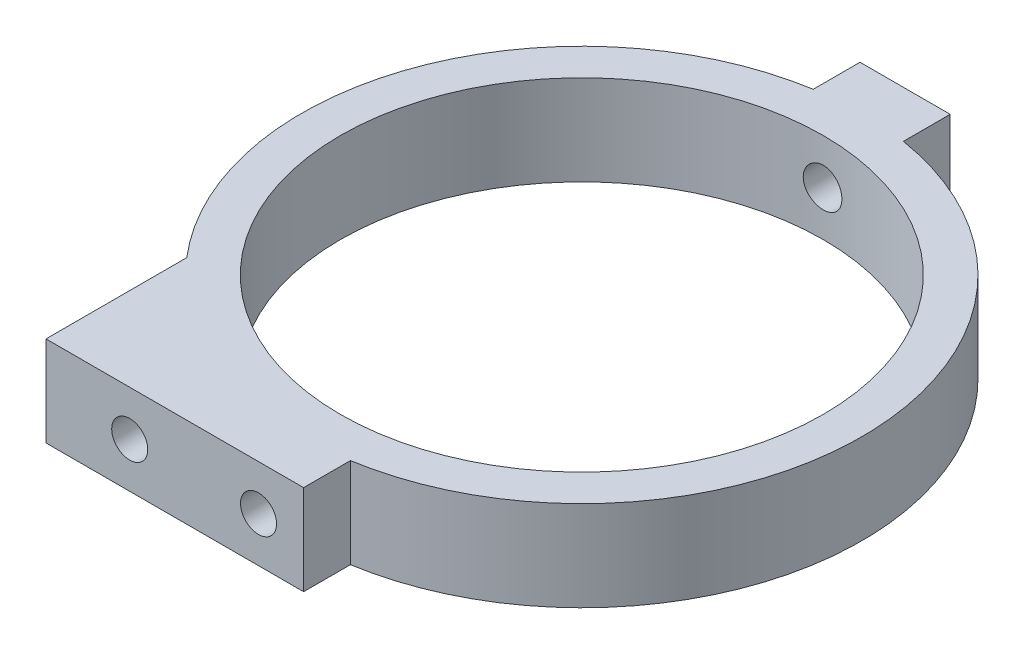
ISO-10303-21;
HEADER;
FILE_DESCRIPTION(('STEP AP214'),'2;1');
FILE_NAME('part.step','',(''),(''),'','','');
FILE_SCHEMA(('AUTOMOTIVE_DESIGN { 1 0 10303 214 1 1 1 1 }'));
ENDSEC;
DATA;
#1=APPLICATION_CONTEXT('core data for automotive mechanical design processes');
#2=APPLICATION_PROTOCOL_DEFINITION('international standard','automotive_design',2000,#1);
#3=PRODUCT_CONTEXT('',#1,'mechanical');
#4=PRODUCT('Part','Part','',(#3));
#5=PRODUCT_RELATED_PRODUCT_CATEGORY('part','',(#4));
#6=PRODUCT_DEFINITION_FORMATION('','',#4);
#7=PRODUCT_DEFINITION_CONTEXT('part definition',#1,'design');
#8=PRODUCT_DEFINITION('design','',#6,#7);
#9=PRODUCT_DEFINITION_SHAPE('','',#8);
#10=(LENGTH_UNIT() NAMED_UNIT(*) SI_UNIT(.MILLI.,.METRE.));
#11=(NAMED_UNIT(*) PLANE_ANGLE_UNIT() SI_UNIT($,.RADIAN.));
#12=(NAMED_UNIT(*) SI_UNIT($,.STERADIAN.) SOLID_ANGLE_UNIT());
#13=UNCERTAINTY_MEASURE_WITH_UNIT(LENGTH_MEASURE(1.E-05),#10,'distance_accuracy_value','');
#14=(GEOMETRIC_REPRESENTATION_CONTEXT(3) GLOBAL_UNCERTAINTY_ASSIGNED_CONTEXT((#13)) GLOBAL_UNIT_ASSIGNED_CONTEXT((#10,
#11,#12)) REPRESENTATION_CONTEXT('',''));
#15=CARTESIAN_POINT('',(0.,0.,0.));
#16=DIRECTION('',(0.,0.,1.));
#17=DIRECTION('',(1.,0.,0.));
#18=AXIS2_PLACEMENT_3D('',#15,#16,#17);
#19=CARTESIAN_POINT('',(0.,7.,0.));
#20=DIRECTION('',(0.,1.,0.));
#21=DIRECTION('',(0.,0.,-1.));
#22=AXIS2_PLACEMENT_3D('',#19,#20,#21);
#23=PLANE('',#22);
#24=DIRECTION('',(0.,0.,1.));
#25=VECTOR('',#24,1.);
#26=CARTESIAN_POINT('',(3.5,7.,-25.1));
#27=LINE('',#26,#25);
#28=CARTESIAN_POINT('',(3.5,7.,-25.1));
#29=VERTEX_POINT('',#28);
#30=CARTESIAN_POINT('',(3.5,7.,-21.4665437367081));
#31=VERTEX_POINT('',#30);
#32=EDGE_CURVE('E159',#29,#31,#27,.T.);
#33=ORIENTED_EDGE('',*,*,#32,.F.);
#34=DIRECTION('',(-1.,0.,0.));
#35=VECTOR('',#34,1.);
#36=CARTESIAN_POINT('',(3.5,7.,-25.1));
#37=LINE('',#36,#35);
#38=CARTESIAN_POINT('',(-3.5,7.,-25.1));
#39=VERTEX_POINT('',#38);
#40=EDGE_CURVE('E136',#29,#39,#37,.T.);
#41=ORIENTED_EDGE('',*,*,#40,.T.);
#42=DIRECTION('',(0.,0.,1.));
#43=VECTOR('',#42,1.);
#44=CARTESIAN_POINT('',(-3.5,7.,-25.1));
#45=LINE('',#44,#43);
#46=CARTESIAN_POINT('',(-3.5,7.,-21.4665437367081));
#47=VERTEX_POINT('',#46);
#48=EDGE_CURVE('E119',#39,#47,#45,.T.);
#49=ORIENTED_EDGE('',*,*,#48,.T.);
#50=CARTESIAN_POINT('',(0.,7.,0.));
#51=DIRECTION('',(0.,-1.,0.));
#52=DIRECTION('',(0.,0.,-1.));
#53=AXIS2_PLACEMENT_3D('',#50,#51,#52);
#54=CIRCLE('',#53,21.75);
#55=CARTESIAN_POINT('',(-16.5,7.,14.1708327207684));
#56=VERTEX_POINT('',#55);
#57=EDGE_CURVE('E128',#56,#47,#54,.T.);
#58=ORIENTED_EDGE('',*,*,#57,.F.);
#59=DIRECTION('',(0.,0.,1.));
#60=VECTOR('',#59,1.);
#61=CARTESIAN_POINT('',(-16.5,7.,25.1));
#62=LINE('',#61,#60);
#63=CARTESIAN_POINT('',(-16.5,7.,25.1));
#64=VERTEX_POINT('',#63);
#65=EDGE_CURVE('E190',#56,#64,#62,.T.);
#66=ORIENTED_EDGE('',*,*,#65,.T.);
#67=DIRECTION('',(-1.,0.,0.));
#68=VECTOR('',#67,1.);
#69=CARTESIAN_POINT('',(3.5,7.,25.1));
#70=LINE('',#69,#68);
#71=CARTESIAN_POINT('',(3.5,7.,25.1));
#72=VERTEX_POINT('',#71);
#73=EDGE_CURVE('E132',#72,#64,#70,.T.);
#74=ORIENTED_EDGE('',*,*,#73,.F.);
#75=DIRECTION('',(0.,0.,-1.));
#76=VECTOR('',#75,1.);
#77=CARTESIAN_POINT('',(3.5,7.,25.1));
#78=LINE('',#77,#76);
#79=CARTESIAN_POINT('',(3.5,7.,21.4665437367081));
#80=VERTEX_POINT('',#79);
#81=EDGE_CURVE('E175',#72,#80,#78,.T.);
#82=ORIENTED_EDGE('',*,*,#81,.T.);
#83=CARTESIAN_POINT('',(0.,7.,0.));
#84=DIRECTION('',(0.,-1.,0.));
#85=DIRECTION('',(0.,0.,-1.));
#86=AXIS2_PLACEMENT_3D('',#83,#84,#85);
#87=CIRCLE('',#86,21.75);
#88=EDGE_CURVE('E164',#31,#80,#87,.T.);
#89=ORIENTED_EDGE('',*,*,#88,.F.);
#90=EDGE_LOOP('',(#33,#41,#49,#58,#66,#74,#82,#89));
#91=FACE_BOUND('',#90,.T.);
#92=CARTESIAN_POINT('',(0.,7.,0.));
#93=DIRECTION('',(0.,-1.,0.));
#94=DIRECTION('',(0.,0.,-1.));
#95=AXIS2_PLACEMENT_3D('',#92,#93,#94);
#96=CIRCLE('',#95,18.75);
#97=CARTESIAN_POINT('',(0.,7.,-18.75));
#98=VERTEX_POINT('',#97);
#99=EDGE_CURVE('E145',#98,#98,#96,.T.);
#100=ORIENTED_EDGE('',*,*,#99,.T.);
#101=EDGE_LOOP('',(#100));
#102=FACE_BOUND('',#101,.T.);
#103=ADVANCED_FACE('F41',(#91,#102),#23,.T.);
#104=CARTESIAN_POINT('',(0.,0.,0.));
#105=DIRECTION('',(0.,1.,0.));
#106=DIRECTION('',(0.,0.,-1.));
#107=AXIS2_PLACEMENT_3D('',#104,#105,#106);
#108=PLANE('',#107);
#109=DIRECTION('',(0.,0.,1.));
#110=VECTOR('',#109,1.);
#111=CARTESIAN_POINT('',(3.5,0.,-25.1));
#112=LINE('',#111,#110);
#113=CARTESIAN_POINT('',(3.5,0.,-25.1));
#114=VERTEX_POINT('',#113);
#115=CARTESIAN_POINT('',(3.5,0.,-21.4665437367081));
#116=VERTEX_POINT('',#115);
#117=EDGE_CURVE('E141',#114,#116,#112,.T.);
#118=ORIENTED_EDGE('',*,*,#117,.T.);
#119=CARTESIAN_POINT('',(0.,0.,0.));
#120=DIRECTION('',(0.,-1.,0.));
#121=DIRECTION('',(0.,0.,-1.));
#122=AXIS2_PLACEMENT_3D('',#119,#120,#121);
#123=CIRCLE('',#122,21.75);
#124=CARTESIAN_POINT('',(3.5,0.,21.4665437367081));
#125=VERTEX_POINT('',#124);
#126=EDGE_CURVE('E144',#116,#125,#123,.T.);
#127=ORIENTED_EDGE('',*,*,#126,.T.);
#128=DIRECTION('',(0.,0.,-1.));
#129=VECTOR('',#128,1.);
#130=CARTESIAN_POINT('',(3.5,0.,25.1));
#131=LINE('',#130,#129);
#132=CARTESIAN_POINT('',(3.5,0.,25.1));
#133=VERTEX_POINT('',#132);
#134=EDGE_CURVE('E148',#133,#125,#131,.T.);
#135=ORIENTED_EDGE('',*,*,#134,.F.);
#136=DIRECTION('',(-1.,0.,0.));
#137=VECTOR('',#136,1.);
#138=CARTESIAN_POINT('',(3.5,0.,25.1));
#139=LINE('',#138,#137);
#140=CARTESIAN_POINT('',(-16.5,0.,25.1));
#141=VERTEX_POINT('',#140);
#142=EDGE_CURVE('E151',#133,#141,#139,.T.);
#143=ORIENTED_EDGE('',*,*,#142,.T.);
#144=DIRECTION('',(0.,0.,1.));
#145=VECTOR('',#144,1.);
#146=CARTESIAN_POINT('',(-16.5,0.,25.1));
#147=LINE('',#146,#145);
#148=CARTESIAN_POINT('',(-16.5,0.,14.1708327207684));
#149=VERTEX_POINT('',#148);
#150=EDGE_CURVE('E192',#149,#141,#147,.T.);
#151=ORIENTED_EDGE('',*,*,#150,.F.);
#152=CARTESIAN_POINT('',(0.,0.,0.));
#153=DIRECTION('',(0.,-1.,0.));
#154=DIRECTION('',(0.,0.,-1.));
#155=AXIS2_PLACEMENT_3D('',#152,#153,#154);
#156=CIRCLE('',#155,21.75);
#157=CARTESIAN_POINT('',(-3.5,0.,-21.4665437367081));
#158=VERTEX_POINT('',#157);
#159=EDGE_CURVE('E154',#149,#158,#156,.T.);
#160=ORIENTED_EDGE('',*,*,#159,.T.);
#161=DIRECTION('',(0.,0.,1.));
#162=VECTOR('',#161,1.);
#163=CARTESIAN_POINT('',(-3.5,0.,-25.1));
#164=LINE('',#163,#162);
#165=CARTESIAN_POINT('',(-3.5,0.,-25.1));
#166=VERTEX_POINT('',#165);
#167=EDGE_CURVE('E122',#166,#158,#164,.T.);
#168=ORIENTED_EDGE('',*,*,#167,.F.);
#169=DIRECTION('',(-1.,0.,0.));
#170=VECTOR('',#169,1.);
#171=CARTESIAN_POINT('',(3.5,0.,-25.1));
#172=LINE('',#171,#170);
#173=EDGE_CURVE('E157',#114,#166,#172,.T.);
#174=ORIENTED_EDGE('',*,*,#173,.F.);
#175=EDGE_LOOP('',(#118,#127,#135,#143,#151,#160,#168,#174));
#176=FACE_BOUND('',#175,.T.);
#177=CARTESIAN_POINT('',(0.,0.,0.));
#178=DIRECTION('',(0.,-1.,0.));
#179=DIRECTION('',(0.,0.,-1.));
#180=AXIS2_PLACEMENT_3D('',#177,#178,#179);
#181=CIRCLE('',#180,18.75);
#182=CARTESIAN_POINT('',(0.,0.,-18.75));
#183=VERTEX_POINT('',#182);
#184=EDGE_CURVE('E178',#183,#183,#181,.T.);
#185=ORIENTED_EDGE('',*,*,#184,.F.);
#186=EDGE_LOOP('',(#185));
#187=FACE_BOUND('',#186,.T.);
#188=ADVANCED_FACE('F172',(#176,#187),#108,.F.);
#189=CARTESIAN_POINT('',(3.5,7.,-25.1));
#190=DIRECTION('',(-1.,0.,0.));
#191=DIRECTION('',(0.,0.,-1.));
#192=AXIS2_PLACEMENT_3D('',#189,#190,#191);
#193=PLANE('',#192);
#194=ORIENTED_EDGE('',*,*,#117,.F.);
#195=DIRECTION('',(0.,-1.,0.));
#196=VECTOR('',#195,1.);
#197=CARTESIAN_POINT('',(3.5,7.,-25.1));
#198=LINE('',#197,#196);
#199=EDGE_CURVE('E71',#29,#114,#198,.T.);
#200=ORIENTED_EDGE('',*,*,#199,.F.);
#201=ORIENTED_EDGE('',*,*,#32,.T.);
#202=DIRECTION('',(0.,-1.,0.));
#203=VECTOR('',#202,1.);
#204=CARTESIAN_POINT('',(3.5,7.,-21.4665437367081));
#205=LINE('',#204,#203);
#206=EDGE_CURVE('E11',#31,#116,#205,.T.);
#207=ORIENTED_EDGE('',*,*,#206,.T.);
#208=EDGE_LOOP('',(#194,#200,#201,#207));
#209=FACE_BOUND('',#208,.T.);
#210=ADVANCED_FACE('F43',(#209),#193,.F.);
#211=CARTESIAN_POINT('',(0.,7.,0.));
#212=DIRECTION('',(0.,-1.,0.));
#213=DIRECTION('',(0.,0.,1.));
#214=AXIS2_PLACEMENT_3D('',#211,#212,#213);
#215=CYLINDRICAL_SURFACE('',#214,21.75);
#216=ORIENTED_EDGE('',*,*,#126,.F.);
#217=ORIENTED_EDGE('',*,*,#206,.F.);
#218=ORIENTED_EDGE('',*,*,#88,.T.);
#219=DIRECTION('',(0.,-1.,0.));
#220=VECTOR('',#219,1.);
#221=CARTESIAN_POINT('',(3.5,7.,21.4665437367081));
#222=LINE('',#221,#220);
#223=EDGE_CURVE('E55',#80,#125,#222,.T.);
#224=ORIENTED_EDGE('',*,*,#223,.T.);
#225=EDGE_LOOP('',(#216,#217,#218,#224));
#226=FACE_BOUND('',#225,.T.);
#227=ADVANCED_FACE('F163',(#226),#215,.T.);
#228=CARTESIAN_POINT('',(3.5,7.,25.1));
#229=DIRECTION('',(1.,0.,0.));
#230=DIRECTION('',(0.,0.,1.));
#231=AXIS2_PLACEMENT_3D('',#228,#229,#230);
#232=PLANE('',#231);
#233=ORIENTED_EDGE('',*,*,#134,.T.);
#234=ORIENTED_EDGE('',*,*,#223,.F.);
#235=ORIENTED_EDGE('',*,*,#81,.F.);
#236=DIRECTION('',(0.,-1.,0.));
#237=VECTOR('',#236,1.);
#238=CARTESIAN_POINT('',(3.5,7.,25.1));
#239=LINE('',#238,#237);
#240=EDGE_CURVE('E124',#72,#133,#239,.T.);
#241=ORIENTED_EDGE('',*,*,#240,.T.);
#242=EDGE_LOOP('',(#233,#234,#235,#241));
#243=FACE_BOUND('',#242,.T.);
#244=ADVANCED_FACE('F169',(#243),#232,.T.);
#245=CARTESIAN_POINT('',(3.5,7.,25.1));
#246=DIRECTION('',(0.,0.,-1.));
#247=DIRECTION('',(1.,0.,0.));
#248=AXIS2_PLACEMENT_3D('',#245,#246,#247);
#249=PLANE('',#248);
#250=CARTESIAN_POINT('',(-10.,3.5,25.1));
#251=DIRECTION('',(0.,0.,-1.));
#252=DIRECTION('',(-1.,0.,0.));
#253=AXIS2_PLACEMENT_3D('',#250,#251,#252);
#254=CIRCLE('',#253,1.4);
#255=CARTESIAN_POINT('',(-11.4,3.5,25.1));
#256=VERTEX_POINT('',#255);
#257=EDGE_CURVE('E198',#256,#256,#254,.T.);
#258=ORIENTED_EDGE('',*,*,#257,.T.);
#259=EDGE_LOOP('',(#258));
#260=FACE_BOUND('',#259,.T.);
#261=CARTESIAN_POINT('',(0.,3.5,25.1));
#262=DIRECTION('',(0.,0.,-1.));
#263=DIRECTION('',(-1.,0.,0.));
#264=AXIS2_PLACEMENT_3D('',#261,#262,#263);
#265=CIRCLE('',#264,1.4);
#266=CARTESIAN_POINT('',(-1.40000000000001,3.5,25.1));
#267=VERTEX_POINT('',#266);
#268=EDGE_CURVE('E201',#267,#267,#265,.T.);
#269=ORIENTED_EDGE('',*,*,#268,.T.);
#270=EDGE_LOOP('',(#269));
#271=FACE_BOUND('',#270,.T.);
#272=ORIENTED_EDGE('',*,*,#142,.F.);
#273=ORIENTED_EDGE('',*,*,#240,.F.);
#274=ORIENTED_EDGE('',*,*,#73,.T.);
#275=DIRECTION('',(0.,-1.,0.));
#276=VECTOR('',#275,1.);
#277=CARTESIAN_POINT('',(-16.5,7.,25.1));
#278=LINE('',#277,#276);
#279=EDGE_CURVE('E187',#64,#141,#278,.T.);
#280=ORIENTED_EDGE('',*,*,#279,.T.);
#281=EDGE_LOOP('',(#272,#273,#274,#280));
#282=FACE_BOUND('',#281,.T.);
#283=ADVANCED_FACE('F185',(#260,#271,#282),#249,.F.);
#284=CARTESIAN_POINT('',(0.,7.,0.));
#285=DIRECTION('',(0.,-1.,0.));
#286=DIRECTION('',(0.,0.,1.));
#287=AXIS2_PLACEMENT_3D('',#284,#285,#286);
#288=CYLINDRICAL_SURFACE('',#287,21.75);
#289=ORIENTED_EDGE('',*,*,#57,.T.);
#290=DIRECTION('',(0.,-1.,0.));
#291=VECTOR('',#290,1.);
#292=CARTESIAN_POINT('',(-3.5,7.,-21.4665437367081));
#293=LINE('',#292,#291);
#294=EDGE_CURVE('E116',#47,#158,#293,.T.);
#295=ORIENTED_EDGE('',*,*,#294,.T.);
#296=ORIENTED_EDGE('',*,*,#159,.F.);
#297=DIRECTION('',(0.,-1.,0.));
#298=VECTOR('',#297,1.);
#299=CARTESIAN_POINT('',(-16.5,7.,14.1708327207684));
#300=LINE('',#299,#298);
#301=EDGE_CURVE('E62',#56,#149,#300,.T.);
#302=ORIENTED_EDGE('',*,*,#301,.F.);
#303=EDGE_LOOP('',(#289,#295,#296,#302));
#304=FACE_BOUND('',#303,.T.);
#305=ADVANCED_FACE('F129',(#304),#288,.T.);
#306=CARTESIAN_POINT('',(-3.5,7.,-25.1));
#307=DIRECTION('',(-1.,0.,0.));
#308=DIRECTION('',(0.,0.,-1.));
#309=AXIS2_PLACEMENT_3D('',#306,#307,#308);
#310=PLANE('',#309);
#311=ORIENTED_EDGE('',*,*,#167,.T.);
#312=ORIENTED_EDGE('',*,*,#294,.F.);
#313=ORIENTED_EDGE('',*,*,#48,.F.);
#314=DIRECTION('',(0.,-1.,0.));
#315=VECTOR('',#314,1.);
#316=CARTESIAN_POINT('',(-3.5,7.,-25.1));
#317=LINE('',#316,#315);
#318=EDGE_CURVE('E125',#39,#166,#317,.T.);
#319=ORIENTED_EDGE('',*,*,#318,.T.);
#320=EDGE_LOOP('',(#311,#312,#313,#319));
#321=FACE_BOUND('',#320,.T.);
#322=ADVANCED_FACE('F117',(#321),#310,.T.);
#323=CARTESIAN_POINT('',(3.5,7.,-25.1));
#324=DIRECTION('',(0.,0.,-1.));
#325=DIRECTION('',(1.,0.,0.));
#326=AXIS2_PLACEMENT_3D('',#323,#324,#325);
#327=PLANE('',#326);
#328=CARTESIAN_POINT('',(0.,3.5,-25.1));
#329=DIRECTION('',(0.,0.,1.));
#330=DIRECTION('',(1.,0.,0.));
#331=AXIS2_PLACEMENT_3D('',#328,#329,#330);
#332=CIRCLE('',#331,1.5);
#333=CARTESIAN_POINT('',(1.5,3.5,-25.1));
#334=VERTEX_POINT('',#333);
#335=EDGE_CURVE('E206',#334,#334,#332,.T.);
#336=ORIENTED_EDGE('',*,*,#335,.T.);
#337=EDGE_LOOP('',(#336));
#338=FACE_BOUND('',#337,.T.);
#339=ORIENTED_EDGE('',*,*,#173,.T.);
#340=ORIENTED_EDGE('',*,*,#318,.F.);
#341=ORIENTED_EDGE('',*,*,#40,.F.);
#342=ORIENTED_EDGE('',*,*,#199,.T.);
#343=EDGE_LOOP('',(#339,#340,#341,#342));
#344=FACE_BOUND('',#343,.T.);
#345=ADVANCED_FACE('F227',(#338,#344),#327,.T.);
#346=CARTESIAN_POINT('',(0.,7.,0.));
#347=DIRECTION('',(0.,-1.,0.));
#348=DIRECTION('',(0.,0.,1.));
#349=AXIS2_PLACEMENT_3D('',#346,#347,#348);
#350=CYLINDRICAL_SURFACE('',#349,18.75);
#351=CARTESIAN_POINT('',(1.5,3.5,-18.6899036915657));
#352=CARTESIAN_POINT('',(1.49999632062772,3.41588910974437,-18.6899044892014));
#353=CARTESIAN_POINT('',(1.49290156215183,3.3317206652062,-18.6904775942158));
#354=CARTESIAN_POINT('',(1.46470318774386,3.16571175768858,-18.6927081206783));
#355=CARTESIAN_POINT('',(1.44358362109166,3.08387405616433,-18.6943667767162));
#356=CARTESIAN_POINT('',(1.38794959023862,2.92495508136651,-18.6985793452206));
#357=CARTESIAN_POINT('',(1.35344262614257,2.84787117282067,-18.7011327563356));
#358=CARTESIAN_POINT('',(1.27202646042832,2.70060821925846,-18.7068465005001));
#359=CARTESIAN_POINT('',(1.22511994393665,2.630427683824,-18.7100067021084));
#360=CARTESIAN_POINT('',(1.12011551831489,2.49877819168836,-18.7165863916315));
#361=CARTESIAN_POINT('',(1.06199424933048,2.43732789187484,-18.7200064115608));
#362=CARTESIAN_POINT('',(0.936259445760343,2.32504341460093,-18.7267155033906));
#363=CARTESIAN_POINT('',(0.868645500088394,2.27420969713547,-18.7300045696121));
#364=CARTESIAN_POINT('',(0.725734168475946,2.18453992472742,-18.7360861453358));
#365=CARTESIAN_POINT('',(0.650426681655086,2.14571991903267,-18.738877988498));
#366=CARTESIAN_POINT('',(0.494336491088885,2.08128219450257,-18.7436448358792));
#367=CARTESIAN_POINT('',(0.413553876517281,2.05566426070272,-18.745619853398));
#368=CARTESIAN_POINT('',(0.248991495760869,2.01841132760336,-18.7485268054688));
#369=CARTESIAN_POINT('',(0.165218575252358,2.00674626571047,-18.7494609822974));
#370=CARTESIAN_POINT('',(-0.00310101422522166,1.99763728747693,-18.7501885880184));
#371=CARTESIAN_POINT('',(-0.0876476697940369,2.00019312530925,-18.7499820366297));
#372=CARTESIAN_POINT('',(-0.254910958845742,2.01942877416144,-18.7484533122186));
#373=CARTESIAN_POINT('',(-0.337631336820587,2.03607625616637,-18.7471336928186));
#374=CARTESIAN_POINT('',(-0.499099950189813,2.08297238129014,-18.7435302217384));
#375=CARTESIAN_POINT('',(-0.577848150305161,2.11322114518559,-18.7412463614959));
#376=CARTESIAN_POINT('',(-0.729240075628612,2.18649731782168,-18.7359669873138));
#377=CARTESIAN_POINT('',(-0.801876748665349,2.22953923615441,-18.7329706660993));
#378=CARTESIAN_POINT('',(-0.938906754389632,2.32716937813201,-18.7266031809033));
#379=CARTESIAN_POINT('',(-1.00329993315168,2.38175781732721,-18.7232320099247));
#380=CARTESIAN_POINT('',(-1.12220402922705,2.50111371219672,-18.716482638835));
#381=CARTESIAN_POINT('',(-1.17668675797546,2.56590925405083,-18.7131044454878));
#382=CARTESIAN_POINT('',(-1.27400569041641,2.70374207490187,-18.7067312907922));
#383=CARTESIAN_POINT('',(-1.31684188556444,2.77677935994532,-18.7037363297249));
#384=CARTESIAN_POINT('',(-1.38965054864154,2.92904186429338,-18.6984681334495));
#385=CARTESIAN_POINT('',(-1.41962160308561,3.00826776240737,-18.6961949775527));
#386=CARTESIAN_POINT('',(-1.46582859989257,3.17064933913142,-18.6926292502436));
#387=CARTESIAN_POINT('',(-1.48206480809471,3.25380494164879,-18.6913366598524));
#388=CARTESIAN_POINT('',(-1.50030564278629,3.4214389223715,-18.6898814380755));
#389=CARTESIAN_POINT('',(-1.50234955607957,3.50591299971711,-18.6897156874231));
#390=CARTESIAN_POINT('',(-1.49225064585172,3.67400262104635,-18.690524676209));
#391=CARTESIAN_POINT('',(-1.48010794413208,3.75761817239478,-18.6914994058556));
#392=CARTESIAN_POINT('',(-1.44201322164018,3.92150472101421,-18.6944766801575));
#393=CARTESIAN_POINT('',(-1.41607949196744,4.00177999680187,-18.6964778632987));
#394=CARTESIAN_POINT('',(-1.35115745890298,4.15683972413565,-18.7012814234103));
#395=CARTESIAN_POINT('',(-1.31216896221481,4.23162409436024,-18.7040838122436));
#396=CARTESIAN_POINT('',(-1.22214454706965,4.373759059463,-18.7101815822911));
#397=CARTESIAN_POINT('',(-1.17108242281578,4.44109300986021,-18.7134780300796));
#398=CARTESIAN_POINT('',(-1.05839811840015,4.5662476479122,-18.7201888557784));
#399=CARTESIAN_POINT('',(-0.996775770633618,4.62406818454792,-18.7236032355598));
#400=CARTESIAN_POINT('',(-0.864550602263586,4.72868853250665,-18.7301744660023));
#401=CARTESIAN_POINT('',(-0.793927565253147,4.77546283652398,-18.7333307098241));
#402=CARTESIAN_POINT('',(-0.645806640765806,4.85648803992158,-18.7390213036078));
#403=CARTESIAN_POINT('',(-0.568308817352759,4.89073905598699,-18.7415556593639));
#404=CARTESIAN_POINT('',(-0.408730022480179,4.94570151548968,-18.7457141148762));
#405=CARTESIAN_POINT('',(-0.326654535286603,4.96642879824313,-18.7473392791795));
#406=CARTESIAN_POINT('',(-0.160174833719194,4.99380720003187,-18.7495005498768));
#407=CARTESIAN_POINT('',(-0.0757706596510529,5.00045856254326,-18.7500366751083));
#408=CARTESIAN_POINT('',(0.0927188866521085,4.99949357241986,-18.7499594956931));
#409=CARTESIAN_POINT('',(0.176804491059185,4.99191700058234,-18.7493493958487));
#410=CARTESIAN_POINT('',(0.342505049325764,4.96279408533884,-18.7470546664287));
#411=CARTESIAN_POINT('',(0.424119999621,4.94124772178048,-18.7453700353031));
#412=CARTESIAN_POINT('',(0.58256563894844,4.88480677611825,-18.7411153164152));
#413=CARTESIAN_POINT('',(0.6593965525984,4.8499128212543,-18.7385452702617));
#414=CARTESIAN_POINT('',(0.806115934271487,4.76777187152803,-18.7328074295552));
#415=CARTESIAN_POINT('',(0.8760045245382,4.72052509423304,-18.7296396455302));
#416=CARTESIAN_POINT('',(1.00705879886138,4.61487049786707,-18.7230514806532));
#417=CARTESIAN_POINT('',(1.06820077293534,4.55643330967203,-18.7196304499822));
#418=CARTESIAN_POINT('',(1.17983224819666,4.43010829215942,-18.7129268703636));
#419=CARTESIAN_POINT('',(1.23031916134281,4.36221817342083,-18.709644355215));
#420=CARTESIAN_POINT('',(1.31927004620408,4.21879254913323,-18.7035831840147));
#421=CARTESIAN_POINT('',(1.35771272607774,4.14324381313022,-18.7008054238702));
#422=CARTESIAN_POINT('',(1.42131855200279,3.98679387767989,-18.6960792751499));
#423=CARTESIAN_POINT('',(1.44649701682099,3.90589897459956,-18.6941299303474));
#424=CARTESIAN_POINT('',(1.47642337958161,3.77043630193827,-18.691784377361));
#425=CARTESIAN_POINT('',(1.48525291732771,3.71674059854125,-18.6910823459044));
#426=CARTESIAN_POINT('',(1.49704240943925,3.60870461027899,-18.6901417457999));
#427=CARTESIAN_POINT('',(1.5000023781296,3.55436432698718,-18.6899031760209));
#428=CARTESIAN_POINT('',(1.5,3.5,-18.6899036915657));
#429=B_SPLINE_CURVE_WITH_KNOTS('',3,(#351,#352,#353,#354,#355,#356,#357,#358,#359,#360,#361,
#362,#363,#364,#365,#366,#367,#368,#369,#370,#371,#372,#373,#374,#375,#376,#377,#378,#379,#380,
#381,#382,#383,#384,#385,#386,#387,#388,#389,#390,#391,#392,#393,#394,#395,#396,#397,#398,#399,
#400,#401,#402,#403,#404,#405,#406,#407,#408,#409,#410,#411,#412,#413,#414,#415,#416,#417,#418,
#419,#420,#421,#422,#423,#424,#425,#426,#427,#428),.UNSPECIFIED.,.T.,.F.,(4,2,2,2,2,2,2,2,2,2,2,
2,2,2,2,2,2,2,2,2,2,2,2,2,2,2,2,2,2,2,2,2,2,2,2,2,2,2,4),(0.,0.25213418203791,0.50455561402385,
0.756835834120728,1.00906146755583,1.26181826116902,1.51458600394927,1.7676899785965,
2.02078983191417,2.27334337309686,2.52589254857181,2.77786389180794,3.02983747254223,
3.28209793140011,3.53436309986935,3.78733494058949,4.0403069669025,4.29330677998519,
4.54630169612057,4.79859599700462,5.05088813179099,5.30284648195618,5.55480856292754,
5.80732263043169,6.05984070604075,6.31293630132195,6.56602953833693,6.8188258119051,
7.07161771273227,7.32370386856552,7.5757903880512,7.82786506275495,8.07993529802616,
8.33267638790938,8.5854787963961,8.83872562068804,9.09167932690653,9.25464441416333,
9.41760910369755),.UNSPECIFIED.);
#430=CARTESIAN_POINT('',(1.5,3.5,-18.6899036915657));
#431=VERTEX_POINT('',#430);
#432=EDGE_CURVE('E45',#431,#431,#429,.T.);
#433=ORIENTED_EDGE('',*,*,#432,.T.);
#434=EDGE_LOOP('',(#433));
#435=FACE_BOUND('',#434,.T.);
#436=ORIENTED_EDGE('',*,*,#99,.F.);
#437=EDGE_LOOP('',(#436));
#438=FACE_BOUND('',#437,.T.);
#439=ORIENTED_EDGE('',*,*,#184,.T.);
#440=EDGE_LOOP('',(#439));
#441=FACE_BOUND('',#440,.T.);
#442=ADVANCED_FACE('F218',(#435,#438,#441),#350,.F.);
#443=CARTESIAN_POINT('',(0.,3.5,-18.1));
#444=DIRECTION('',(0.,0.,-1.));
#445=DIRECTION('',(1.,0.,0.));
#446=AXIS2_PLACEMENT_3D('',#443,#444,#445);
#447=CYLINDRICAL_SURFACE('',#446,1.5);
#448=ORIENTED_EDGE('',*,*,#432,.F.);
#449=EDGE_LOOP('',(#448));
#450=FACE_BOUND('',#449,.T.);
#451=ORIENTED_EDGE('',*,*,#335,.F.);
#452=EDGE_LOOP('',(#451));
#453=FACE_BOUND('',#452,.T.);
#454=ADVANCED_FACE('F221',(#450,#453),#447,.F.);
#455=CARTESIAN_POINT('',(0.,3.5,20.1));
#456=DIRECTION('',(0.,0.,1.));
#457=DIRECTION('',(-1.,0.,0.));
#458=AXIS2_PLACEMENT_3D('',#455,#456,#457);
#459=CYLINDRICAL_SURFACE('',#458,1.4);
#460=CARTESIAN_POINT('',(0.,3.5,20.1));
#461=DIRECTION('',(0.,0.,-1.));
#462=DIRECTION('',(-1.,0.,0.));
#463=AXIS2_PLACEMENT_3D('',#460,#461,#462);
#464=CIRCLE('',#463,1.4);
#465=CARTESIAN_POINT('',(-1.4,3.5,20.1));
#466=VERTEX_POINT('',#465);
#467=EDGE_CURVE('E203',#466,#466,#464,.T.);
#468=ORIENTED_EDGE('',*,*,#467,.T.);
#469=EDGE_LOOP('',(#468));
#470=FACE_BOUND('',#469,.T.);
#471=ORIENTED_EDGE('',*,*,#268,.F.);
#472=EDGE_LOOP('',(#471));
#473=FACE_BOUND('',#472,.T.);
#474=ADVANCED_FACE('F224',(#470,#473),#459,.F.);
#475=CARTESIAN_POINT('',(0.,3.5,20.1));
#476=DIRECTION('',(0.,0.,1.));
#477=DIRECTION('',(-1.,0.,0.));
#478=AXIS2_PLACEMENT_3D('',#475,#476,#477);
#479=PLANE('',#478);
#480=ORIENTED_EDGE('',*,*,#467,.F.);
#481=EDGE_LOOP('',(#480));
#482=FACE_BOUND('',#481,.T.);
#483=ADVANCED_FACE('F235',(#482),#479,.T.);
#484=CARTESIAN_POINT('',(-16.5,7.,25.1));
#485=DIRECTION('',(-1.,0.,0.));
#486=DIRECTION('',(0.,0.,-1.));
#487=AXIS2_PLACEMENT_3D('',#484,#485,#486);
#488=PLANE('',#487);
#489=ORIENTED_EDGE('',*,*,#150,.T.);
#490=ORIENTED_EDGE('',*,*,#279,.F.);
#491=ORIENTED_EDGE('',*,*,#65,.F.);
#492=ORIENTED_EDGE('',*,*,#301,.T.);
#493=EDGE_LOOP('',(#489,#490,#491,#492));
#494=FACE_BOUND('',#493,.T.);
#495=ADVANCED_FACE('F232',(#494),#488,.T.);
#496=CARTESIAN_POINT('',(-10.,3.5,18.1));
#497=DIRECTION('',(0.,0.,1.));
#498=DIRECTION('',(-1.,0.,0.));
#499=AXIS2_PLACEMENT_3D('',#496,#497,#498);
#500=CYLINDRICAL_SURFACE('',#499,1.4);
#501=CARTESIAN_POINT('',(-10.,3.5,18.1));
#502=DIRECTION('',(0.,0.,-1.));
#503=DIRECTION('',(-1.,0.,0.));
#504=AXIS2_PLACEMENT_3D('',#501,#502,#503);
#505=CIRCLE('',#504,1.4);
#506=CARTESIAN_POINT('',(-11.4,3.5,18.1));
#507=VERTEX_POINT('',#506);
#508=EDGE_CURVE('E195',#507,#507,#505,.T.);
#509=ORIENTED_EDGE('',*,*,#508,.T.);
#510=EDGE_LOOP('',(#509));
#511=FACE_BOUND('',#510,.T.);
#512=ORIENTED_EDGE('',*,*,#257,.F.);
#513=EDGE_LOOP('',(#512));
#514=FACE_BOUND('',#513,.T.);
#515=ADVANCED_FACE('F234',(#511,#514),#500,.F.);
#516=CARTESIAN_POINT('',(-10.,3.5,18.1));
#517=DIRECTION('',(0.,0.,1.));
#518=DIRECTION('',(-1.,0.,0.));
#519=AXIS2_PLACEMENT_3D('',#516,#517,#518);
#520=PLANE('',#519);
#521=ORIENTED_EDGE('',*,*,#508,.F.);
#522=EDGE_LOOP('',(#521));
#523=FACE_BOUND('',#522,.T.);
#524=ADVANCED_FACE('F241',(#523),#520,.T.);
#525=CLOSED_SHELL('',(#103,#188,#210,#227,#244,#283,#305,#322,#345,#442,#454,#474,#483,#495,
#515,#524));
#526=MANIFOLD_SOLID_BREP('B2',#525);
#527=ADVANCED_BREP_SHAPE_REPRESENTATION('',(#18,#526),#14);
#528=SHAPE_DEFINITION_REPRESENTATION(#9,#527);
ENDSEC;
END-ISO-10303-21;
